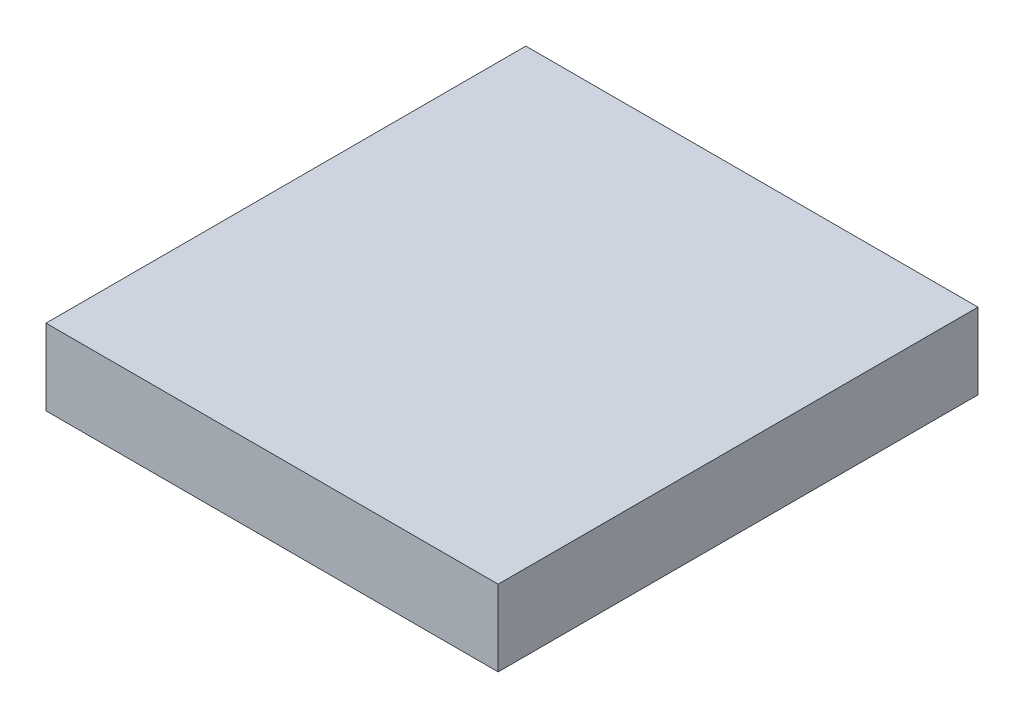
ISO-10303-21;
HEADER;
FILE_DESCRIPTION(('STEP AP214'),'2;1');
FILE_NAME('part.step','',(''),(''),'','','');
FILE_SCHEMA(('AUTOMOTIVE_DESIGN { 1 0 10303 214 1 1 1 1 }'));
ENDSEC;
DATA;
#1=APPLICATION_CONTEXT('core data for automotive mechanical design processes');
#2=APPLICATION_PROTOCOL_DEFINITION('international standard','automotive_design',2000,#1);
#3=PRODUCT_CONTEXT('',#1,'mechanical');
#4=PRODUCT('Part','Part','',(#3));
#5=PRODUCT_RELATED_PRODUCT_CATEGORY('part','',(#4));
#6=PRODUCT_DEFINITION_FORMATION('','',#4);
#7=PRODUCT_DEFINITION_CONTEXT('part definition',#1,'design');
#8=PRODUCT_DEFINITION('design','',#6,#7);
#9=PRODUCT_DEFINITION_SHAPE('','',#8);
#10=(LENGTH_UNIT() NAMED_UNIT(*) SI_UNIT(.MILLI.,.METRE.));
#11=(NAMED_UNIT(*) PLANE_ANGLE_UNIT() SI_UNIT($,.RADIAN.));
#12=(NAMED_UNIT(*) SI_UNIT($,.STERADIAN.) SOLID_ANGLE_UNIT());
#13=UNCERTAINTY_MEASURE_WITH_UNIT(LENGTH_MEASURE(1.E-05),#10,'distance_accuracy_value','');
#14=(GEOMETRIC_REPRESENTATION_CONTEXT(3) GLOBAL_UNCERTAINTY_ASSIGNED_CONTEXT((#13)) GLOBAL_UNIT_ASSIGNED_CONTEXT((#10,
#11,#12)) REPRESENTATION_CONTEXT('',''));
#15=CARTESIAN_POINT('',(0.,0.,0.));
#16=DIRECTION('',(0.,0.,1.));
#17=DIRECTION('',(1.,0.,0.));
#18=AXIS2_PLACEMENT_3D('',#15,#16,#17);
#19=CARTESIAN_POINT('',(0.,40.,0.));
#20=DIRECTION('',(1.,0.,0.));
#21=DIRECTION('',(0.,0.,-1.));
#22=AXIS2_PLACEMENT_3D('',#19,#20,#21);
#23=PLANE('',#22);
#24=DIRECTION('',(0.,0.,1.));
#25=VECTOR('',#24,1.);
#26=CARTESIAN_POINT('',(0.,0.,0.));
#27=LINE('',#26,#25);
#28=CARTESIAN_POINT('',(0.,0.,-252.580549317315));
#29=VERTEX_POINT('',#28);
#30=CARTESIAN_POINT('',(0.,0.,0.));
#31=VERTEX_POINT('',#30);
#32=EDGE_CURVE('E107',#29,#31,#27,.T.);
#33=ORIENTED_EDGE('',*,*,#32,.T.);
#34=DIRECTION('',(0.,-1.,0.));
#35=VECTOR('',#34,1.);
#36=CARTESIAN_POINT('',(0.,40.,0.));
#37=LINE('',#36,#35);
#38=CARTESIAN_POINT('',(0.,40.,0.));
#39=VERTEX_POINT('',#38);
#40=EDGE_CURVE('E11',#39,#31,#37,.T.);
#41=ORIENTED_EDGE('',*,*,#40,.F.);
#42=DIRECTION('',(0.,0.,1.));
#43=VECTOR('',#42,1.);
#44=CARTESIAN_POINT('',(0.,40.,0.));
#45=LINE('',#44,#43);
#46=CARTESIAN_POINT('',(0.,40.,-252.580549317315));
#47=VERTEX_POINT('',#46);
#48=EDGE_CURVE('E91',#47,#39,#45,.T.);
#49=ORIENTED_EDGE('',*,*,#48,.F.);
#50=DIRECTION('',(0.,-1.,0.));
#51=VECTOR('',#50,1.);
#52=CARTESIAN_POINT('',(0.,40.,-252.580549317315));
#53=LINE('',#52,#51);
#54=EDGE_CURVE('E103',#47,#29,#53,.T.);
#55=ORIENTED_EDGE('',*,*,#54,.T.);
#56=EDGE_LOOP('',(#33,#41,#49,#55));
#57=FACE_BOUND('',#56,.T.);
#58=ADVANCED_FACE('F39',(#57),#23,.F.);
#59=CARTESIAN_POINT('',(0.,40.,0.));
#60=DIRECTION('',(0.,0.,-1.));
#61=DIRECTION('',(-1.,0.,0.));
#62=AXIS2_PLACEMENT_3D('',#59,#60,#61);
#63=PLANE('',#62);
#64=DIRECTION('',(1.,0.,0.));
#65=VECTOR('',#64,1.);
#66=CARTESIAN_POINT('',(0.,0.,0.));
#67=LINE('',#66,#65);
#68=CARTESIAN_POINT('',(238.,0.,0.));
#69=VERTEX_POINT('',#68);
#70=EDGE_CURVE('E96',#31,#69,#67,.T.);
#71=ORIENTED_EDGE('',*,*,#70,.T.);
#72=DIRECTION('',(0.,-1.,0.));
#73=VECTOR('',#72,1.);
#74=CARTESIAN_POINT('',(238.,40.,0.));
#75=LINE('',#74,#73);
#76=CARTESIAN_POINT('',(238.,40.,0.));
#77=VERTEX_POINT('',#76);
#78=EDGE_CURVE('E48',#77,#69,#75,.T.);
#79=ORIENTED_EDGE('',*,*,#78,.F.);
#80=DIRECTION('',(1.,0.,0.));
#81=VECTOR('',#80,1.);
#82=CARTESIAN_POINT('',(0.,40.,0.));
#83=LINE('',#82,#81);
#84=EDGE_CURVE('E86',#39,#77,#83,.T.);
#85=ORIENTED_EDGE('',*,*,#84,.F.);
#86=ORIENTED_EDGE('',*,*,#40,.T.);
#87=EDGE_LOOP('',(#71,#79,#85,#86));
#88=FACE_BOUND('',#87,.T.);
#89=ADVANCED_FACE('F95',(#88),#63,.F.);
#90=CARTESIAN_POINT('',(238.,40.,0.));
#91=DIRECTION('',(-1.,0.,0.));
#92=DIRECTION('',(0.,0.,1.));
#93=AXIS2_PLACEMENT_3D('',#90,#91,#92);
#94=PLANE('',#93);
#95=DIRECTION('',(0.,0.,-1.));
#96=VECTOR('',#95,1.);
#97=CARTESIAN_POINT('',(238.,0.,0.));
#98=LINE('',#97,#96);
#99=CARTESIAN_POINT('',(238.,0.,-252.580549317315));
#100=VERTEX_POINT('',#99);
#101=EDGE_CURVE('E73',#69,#100,#98,.T.);
#102=ORIENTED_EDGE('',*,*,#101,.T.);
#103=DIRECTION('',(0.,-1.,0.));
#104=VECTOR('',#103,1.);
#105=CARTESIAN_POINT('',(238.,40.,-252.580549317315));
#106=LINE('',#105,#104);
#107=CARTESIAN_POINT('',(238.,40.,-252.580549317315));
#108=VERTEX_POINT('',#107);
#109=EDGE_CURVE('E98',#108,#100,#106,.T.);
#110=ORIENTED_EDGE('',*,*,#109,.F.);
#111=DIRECTION('',(0.,0.,-1.));
#112=VECTOR('',#111,1.);
#113=CARTESIAN_POINT('',(238.,40.,0.));
#114=LINE('',#113,#112);
#115=EDGE_CURVE('E89',#77,#108,#114,.T.);
#116=ORIENTED_EDGE('',*,*,#115,.F.);
#117=ORIENTED_EDGE('',*,*,#78,.T.);
#118=EDGE_LOOP('',(#102,#110,#116,#117));
#119=FACE_BOUND('',#118,.T.);
#120=ADVANCED_FACE('F99',(#119),#94,.F.);
#121=CARTESIAN_POINT('',(0.,40.,-252.580549317315));
#122=DIRECTION('',(0.,0.,1.));
#123=DIRECTION('',(1.,0.,0.));
#124=AXIS2_PLACEMENT_3D('',#121,#122,#123);
#125=PLANE('',#124);
#126=DIRECTION('',(-1.,0.,0.));
#127=VECTOR('',#126,1.);
#128=CARTESIAN_POINT('',(0.,0.,-252.580549317315));
#129=LINE('',#128,#127);
#130=EDGE_CURVE('E79',#100,#29,#129,.T.);
#131=ORIENTED_EDGE('',*,*,#130,.T.);
#132=ORIENTED_EDGE('',*,*,#54,.F.);
#133=DIRECTION('',(-1.,0.,0.));
#134=VECTOR('',#133,1.);
#135=CARTESIAN_POINT('',(0.,40.,-252.580549317315));
#136=LINE('',#135,#134);
#137=EDGE_CURVE('E56',#108,#47,#136,.T.);
#138=ORIENTED_EDGE('',*,*,#137,.F.);
#139=ORIENTED_EDGE('',*,*,#109,.T.);
#140=EDGE_LOOP('',(#131,#132,#138,#139));
#141=FACE_BOUND('',#140,.T.);
#142=ADVANCED_FACE('F120',(#141),#125,.F.);
#143=CARTESIAN_POINT('',(0.,40.,0.));
#144=DIRECTION('',(0.,-1.,0.));
#145=DIRECTION('',(0.,0.,-1.));
#146=AXIS2_PLACEMENT_3D('',#143,#144,#145);
#147=PLANE('',#146);
#148=ORIENTED_EDGE('',*,*,#48,.T.);
#149=ORIENTED_EDGE('',*,*,#84,.T.);
#150=ORIENTED_EDGE('',*,*,#115,.T.);
#151=ORIENTED_EDGE('',*,*,#137,.T.);
#152=EDGE_LOOP('',(#148,#149,#150,#151));
#153=FACE_BOUND('',#152,.T.);
#154=ADVANCED_FACE('F87',(#153),#147,.F.);
#155=CARTESIAN_POINT('',(0.,0.,0.));
#156=DIRECTION('',(0.,-1.,0.));
#157=DIRECTION('',(0.,0.,-1.));
#158=AXIS2_PLACEMENT_3D('',#155,#156,#157);
#159=PLANE('',#158);
#160=ORIENTED_EDGE('',*,*,#32,.F.);
#161=ORIENTED_EDGE('',*,*,#130,.F.);
#162=ORIENTED_EDGE('',*,*,#101,.F.);
#163=ORIENTED_EDGE('',*,*,#70,.F.);
#164=EDGE_LOOP('',(#160,#161,#162,#163));
#165=FACE_BOUND('',#164,.T.);
#166=ADVANCED_FACE('F123',(#165),#159,.T.);
#167=CLOSED_SHELL('',(#58,#89,#120,#142,#154,#166));
#168=MANIFOLD_SOLID_BREP('B2',#167);
#169=ADVANCED_BREP_SHAPE_REPRESENTATION('',(#18,#168),#14);
#170=SHAPE_DEFINITION_REPRESENTATION(#9,#169);
ENDSEC;
END-ISO-10303-21;
